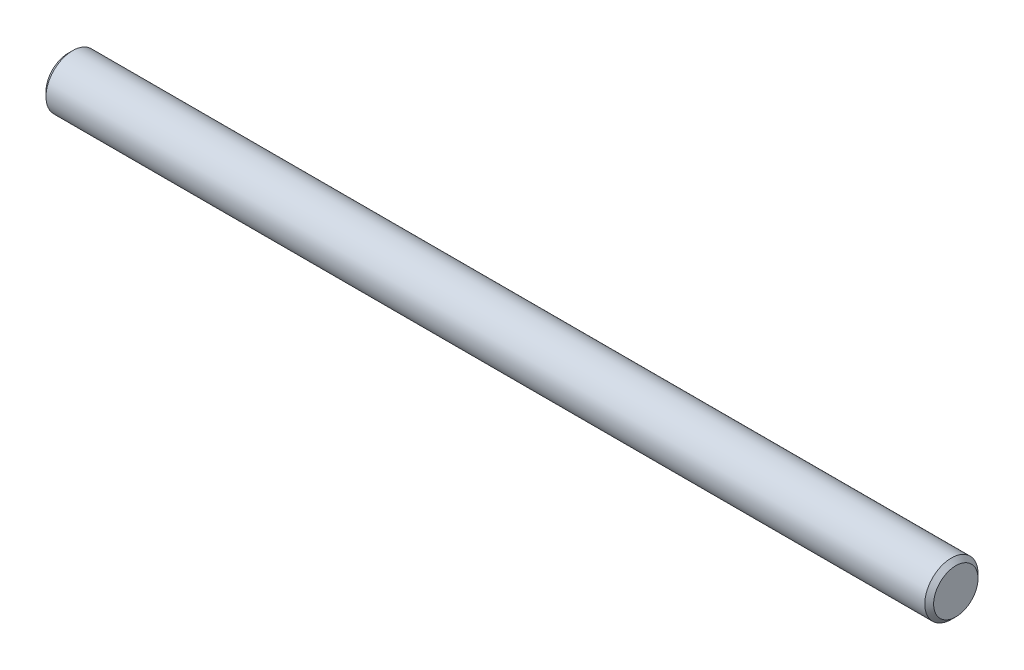
ISO-10303-21;
HEADER;
FILE_DESCRIPTION(('STEP AP214'),'2;1');
FILE_NAME('part.step','',(''),(''),'','','');
FILE_SCHEMA(('AUTOMOTIVE_DESIGN { 1 0 10303 214 1 1 1 1 }'));
ENDSEC;
DATA;
#1=APPLICATION_CONTEXT('core data for automotive mechanical design processes');
#2=APPLICATION_PROTOCOL_DEFINITION('international standard','automotive_design',2000,#1);
#3=PRODUCT_CONTEXT('',#1,'mechanical');
#4=PRODUCT('Part','Part','',(#3));
#5=PRODUCT_RELATED_PRODUCT_CATEGORY('part','',(#4));
#6=PRODUCT_DEFINITION_FORMATION('','',#4);
#7=PRODUCT_DEFINITION_CONTEXT('part definition',#1,'design');
#8=PRODUCT_DEFINITION('design','',#6,#7);
#9=PRODUCT_DEFINITION_SHAPE('','',#8);
#10=(LENGTH_UNIT() NAMED_UNIT(*) SI_UNIT(.MILLI.,.METRE.));
#11=(NAMED_UNIT(*) PLANE_ANGLE_UNIT() SI_UNIT($,.RADIAN.));
#12=(NAMED_UNIT(*) SI_UNIT($,.STERADIAN.) SOLID_ANGLE_UNIT());
#13=UNCERTAINTY_MEASURE_WITH_UNIT(LENGTH_MEASURE(1.E-05),#10,'distance_accuracy_value','');
#14=(GEOMETRIC_REPRESENTATION_CONTEXT(3) GLOBAL_UNCERTAINTY_ASSIGNED_CONTEXT((#13)) GLOBAL_UNIT_ASSIGNED_CONTEXT((#10,
#11,#12)) REPRESENTATION_CONTEXT('',''));
#15=CARTESIAN_POINT('',(0.,0.,0.));
#16=DIRECTION('',(0.,0.,1.));
#17=DIRECTION('',(1.,0.,0.));
#18=AXIS2_PLACEMENT_3D('',#15,#16,#17);
#19=CARTESIAN_POINT('',(50.,0.,0.));
#20=DIRECTION('',(-1.,0.,0.));
#21=DIRECTION('',(0.,0.,1.));
#22=AXIS2_PLACEMENT_3D('',#19,#20,#21);
#23=CYLINDRICAL_SURFACE('',#22,3.);
#24=CARTESIAN_POINT('',(49.5,0.,0.));
#25=DIRECTION('',(1.,0.,0.));
#26=DIRECTION('',(0.,0.,-1.));
#27=AXIS2_PLACEMENT_3D('',#24,#25,#26);
#28=CIRCLE('',#27,3.);
#29=CARTESIAN_POINT('',(49.5,0.,-3.));
#30=VERTEX_POINT('',#29);
#31=EDGE_CURVE('E40',#30,#30,#28,.F.);
#32=ORIENTED_EDGE('',*,*,#31,.T.);
#33=EDGE_LOOP('',(#32));
#34=FACE_BOUND('',#33,.T.);
#35=CARTESIAN_POINT('',(-49.5,0.,0.));
#36=DIRECTION('',(1.,0.,0.));
#37=DIRECTION('',(0.,0.,-1.));
#38=AXIS2_PLACEMENT_3D('',#35,#36,#37);
#39=CIRCLE('',#38,3.);
#40=CARTESIAN_POINT('',(-49.5,0.,-3.));
#41=VERTEX_POINT('',#40);
#42=EDGE_CURVE('E44',#41,#41,#39,.T.);
#43=ORIENTED_EDGE('',*,*,#42,.T.);
#44=EDGE_LOOP('',(#43));
#45=FACE_BOUND('',#44,.T.);
#46=ADVANCED_FACE('F33',(#34,#45),#23,.T.);
#47=CARTESIAN_POINT('',(50.,0.,0.));
#48=DIRECTION('',(1.,0.,0.));
#49=DIRECTION('',(0.,0.,-1.));
#50=AXIS2_PLACEMENT_3D('',#47,#48,#49);
#51=PLANE('',#50);
#52=CARTESIAN_POINT('',(50.,0.,0.));
#53=DIRECTION('',(1.,0.,0.));
#54=DIRECTION('',(0.,0.,-1.));
#55=AXIS2_PLACEMENT_3D('',#52,#53,#54);
#56=CIRCLE('',#55,2.49999999999997);
#57=CARTESIAN_POINT('',(50.,0.,-2.49999999999997));
#58=VERTEX_POINT('',#57);
#59=EDGE_CURVE('E48',#58,#58,#56,.T.);
#60=ORIENTED_EDGE('',*,*,#59,.T.);
#61=EDGE_LOOP('',(#60));
#62=FACE_BOUND('',#61,.T.);
#63=ADVANCED_FACE('F54',(#62),#51,.T.);
#64=CARTESIAN_POINT('',(-50.,0.,0.));
#65=DIRECTION('',(1.,0.,0.));
#66=DIRECTION('',(0.,0.,-1.));
#67=AXIS2_PLACEMENT_3D('',#64,#65,#66);
#68=PLANE('',#67);
#69=CARTESIAN_POINT('',(-50.,0.,0.));
#70=DIRECTION('',(1.,0.,0.));
#71=DIRECTION('',(0.,0.,-1.));
#72=AXIS2_PLACEMENT_3D('',#69,#70,#71);
#73=CIRCLE('',#72,2.5);
#74=CARTESIAN_POINT('',(-50.,0.,-2.5));
#75=VERTEX_POINT('',#74);
#76=EDGE_CURVE('E10',#75,#75,#73,.F.);
#77=ORIENTED_EDGE('',*,*,#76,.T.);
#78=EDGE_LOOP('',(#77));
#79=FACE_BOUND('',#78,.T.);
#80=ADVANCED_FACE('F58',(#79),#68,.F.);
#81=CARTESIAN_POINT('',(50.,0.,0.));
#82=DIRECTION('',(-1.,0.,0.));
#83=DIRECTION('',(0.,0.,1.));
#84=AXIS2_PLACEMENT_3D('',#81,#82,#83);
#85=CONICAL_SURFACE('',#84,2.49999999999997,0.785398163397467);
#86=ORIENTED_EDGE('',*,*,#31,.F.);
#87=EDGE_LOOP('',(#86));
#88=FACE_BOUND('',#87,.T.);
#89=ORIENTED_EDGE('',*,*,#59,.F.);
#90=EDGE_LOOP('',(#89));
#91=FACE_BOUND('',#90,.T.);
#92=ADVANCED_FACE('F56',(#88,#91),#85,.T.);
#93=CARTESIAN_POINT('',(-49.5,0.,0.));
#94=DIRECTION('',(1.,0.,0.));
#95=DIRECTION('',(0.,0.,-1.));
#96=AXIS2_PLACEMENT_3D('',#93,#94,#95);
#97=CONICAL_SURFACE('',#96,3.,0.785398163397446);
#98=ORIENTED_EDGE('',*,*,#76,.F.);
#99=EDGE_LOOP('',(#98));
#100=FACE_BOUND('',#99,.T.);
#101=ORIENTED_EDGE('',*,*,#42,.F.);
#102=EDGE_LOOP('',(#101));
#103=FACE_BOUND('',#102,.T.);
#104=ADVANCED_FACE('F35',(#100,#103),#97,.T.);
#105=CLOSED_SHELL('',(#46,#63,#80,#92,#104));
#106=MANIFOLD_SOLID_BREP('B2',#105);
#107=ADVANCED_BREP_SHAPE_REPRESENTATION('',(#18,#106),#14);
#108=SHAPE_DEFINITION_REPRESENTATION(#9,#107);
ENDSEC;
END-ISO-10303-21;
